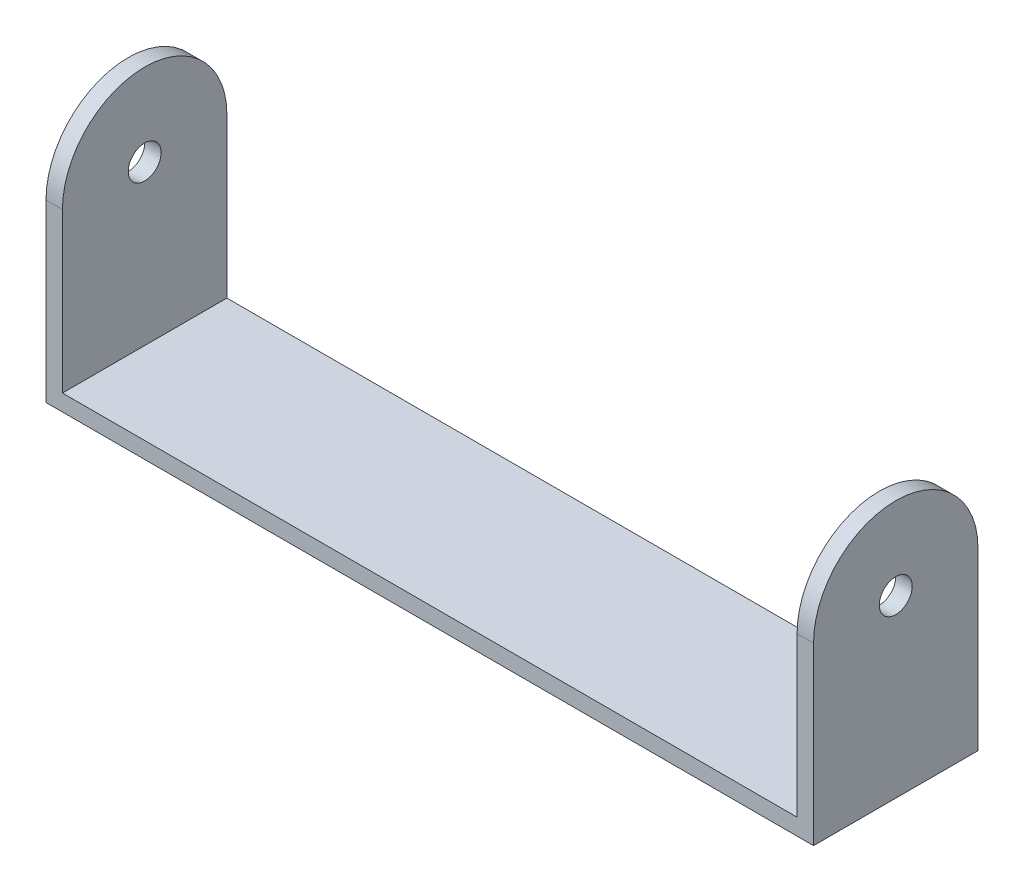
ISO-10303-21;
HEADER;
FILE_DESCRIPTION(('STEP AP214'),'2;1');
FILE_NAME('part.step','',(''),(''),'','','');
FILE_SCHEMA(('AUTOMOTIVE_DESIGN { 1 0 10303 214 1 1 1 1 }'));
ENDSEC;
DATA;
#1=APPLICATION_CONTEXT('core data for automotive mechanical design processes');
#2=APPLICATION_PROTOCOL_DEFINITION('international standard','automotive_design',2000,#1);
#3=PRODUCT_CONTEXT('',#1,'mechanical');
#4=PRODUCT('Part','Part','',(#3));
#5=PRODUCT_RELATED_PRODUCT_CATEGORY('part','',(#4));
#6=PRODUCT_DEFINITION_FORMATION('','',#4);
#7=PRODUCT_DEFINITION_CONTEXT('part definition',#1,'design');
#8=PRODUCT_DEFINITION('design','',#6,#7);
#9=PRODUCT_DEFINITION_SHAPE('','',#8);
#10=(LENGTH_UNIT() NAMED_UNIT(*) SI_UNIT(.MILLI.,.METRE.));
#11=(NAMED_UNIT(*) PLANE_ANGLE_UNIT() SI_UNIT($,.RADIAN.));
#12=(NAMED_UNIT(*) SI_UNIT($,.STERADIAN.) SOLID_ANGLE_UNIT());
#13=UNCERTAINTY_MEASURE_WITH_UNIT(LENGTH_MEASURE(1.E-05),#10,'distance_accuracy_value','');
#14=(GEOMETRIC_REPRESENTATION_CONTEXT(3) GLOBAL_UNCERTAINTY_ASSIGNED_CONTEXT((#13)) GLOBAL_UNIT_ASSIGNED_CONTEXT((#10,
#11,#12)) REPRESENTATION_CONTEXT('',''));
#15=CARTESIAN_POINT('',(0.,0.,0.));
#16=DIRECTION('',(0.,0.,1.));
#17=DIRECTION('',(1.,0.,0.));
#18=AXIS2_PLACEMENT_3D('',#15,#16,#17);
#19=CARTESIAN_POINT('',(35.,1.5,-7.5));
#20=DIRECTION('',(-1.,0.,0.));
#21=DIRECTION('',(0.,0.,1.));
#22=AXIS2_PLACEMENT_3D('',#19,#20,#21);
#23=PLANE('',#22);
#24=CARTESIAN_POINT('',(35.,16.,0.));
#25=DIRECTION('',(-1.,0.,0.));
#26=DIRECTION('',(0.,0.,1.));
#27=AXIS2_PLACEMENT_3D('',#24,#25,#26);
#28=CIRCLE('',#27,1.5);
#29=CARTESIAN_POINT('',(35.,16.,1.5));
#30=VERTEX_POINT('',#29);
#31=EDGE_CURVE('E162',#30,#30,#28,.T.);
#32=ORIENTED_EDGE('',*,*,#31,.T.);
#33=EDGE_LOOP('',(#32));
#34=FACE_BOUND('',#33,.T.);
#35=CARTESIAN_POINT('',(35.,16.,0.));
#36=DIRECTION('',(-1.,0.,0.));
#37=DIRECTION('',(0.,0.,1.));
#38=AXIS2_PLACEMENT_3D('',#35,#36,#37);
#39=CIRCLE('',#38,7.5);
#40=CARTESIAN_POINT('',(35.,16.,7.5));
#41=VERTEX_POINT('',#40);
#42=CARTESIAN_POINT('',(35.,16.,-7.5));
#43=VERTEX_POINT('',#42);
#44=EDGE_CURVE('E133',#41,#43,#39,.T.);
#45=ORIENTED_EDGE('',*,*,#44,.F.);
#46=DIRECTION('',(0.,-1.,0.));
#47=VECTOR('',#46,1.);
#48=CARTESIAN_POINT('',(35.,1.5,7.5));
#49=LINE('',#48,#47);
#50=CARTESIAN_POINT('',(35.,0.,7.5));
#51=VERTEX_POINT('',#50);
#52=EDGE_CURVE('E147',#41,#51,#49,.T.);
#53=ORIENTED_EDGE('',*,*,#52,.T.);
#54=DIRECTION('',(0.,0.,-1.));
#55=VECTOR('',#54,1.);
#56=CARTESIAN_POINT('',(35.,0.,-7.5));
#57=LINE('',#56,#55);
#58=CARTESIAN_POINT('',(35.,0.,-7.5));
#59=VERTEX_POINT('',#58);
#60=EDGE_CURVE('E188',#51,#59,#57,.T.);
#61=ORIENTED_EDGE('',*,*,#60,.T.);
#62=DIRECTION('',(0.,-1.,0.));
#63=VECTOR('',#62,1.);
#64=CARTESIAN_POINT('',(35.,1.5,-7.5));
#65=LINE('',#64,#63);
#66=EDGE_CURVE('E64',#43,#59,#65,.T.);
#67=ORIENTED_EDGE('',*,*,#66,.F.);
#68=EDGE_LOOP('',(#45,#53,#61,#67));
#69=FACE_BOUND('',#68,.T.);
#70=ADVANCED_FACE('F57',(#34,#69),#23,.F.);
#71=CARTESIAN_POINT('',(-35.,1.5,-7.5));
#72=DIRECTION('',(1.,0.,0.));
#73=DIRECTION('',(0.,0.,-1.));
#74=AXIS2_PLACEMENT_3D('',#71,#72,#73);
#75=PLANE('',#74);
#76=CARTESIAN_POINT('',(-35.,16.,0.));
#77=DIRECTION('',(-1.,0.,0.));
#78=DIRECTION('',(0.,0.,1.));
#79=AXIS2_PLACEMENT_3D('',#76,#77,#78);
#80=CIRCLE('',#79,1.5);
#81=CARTESIAN_POINT('',(-35.,16.,1.5));
#82=VERTEX_POINT('',#81);
#83=EDGE_CURVE('E156',#82,#82,#80,.T.);
#84=ORIENTED_EDGE('',*,*,#83,.F.);
#85=EDGE_LOOP('',(#84));
#86=FACE_BOUND('',#85,.T.);
#87=DIRECTION('',(0.,-1.,0.));
#88=VECTOR('',#87,1.);
#89=CARTESIAN_POINT('',(-35.,1.5,7.5));
#90=LINE('',#89,#88);
#91=CARTESIAN_POINT('',(-35.,16.,7.5));
#92=VERTEX_POINT('',#91);
#93=CARTESIAN_POINT('',(-35.,0.,7.5));
#94=VERTEX_POINT('',#93);
#95=EDGE_CURVE('E139',#92,#94,#90,.T.);
#96=ORIENTED_EDGE('',*,*,#95,.F.);
#97=CARTESIAN_POINT('',(-35.,16.,0.));
#98=DIRECTION('',(-1.,0.,0.));
#99=DIRECTION('',(0.,0.,1.));
#100=AXIS2_PLACEMENT_3D('',#97,#98,#99);
#101=CIRCLE('',#100,7.5);
#102=CARTESIAN_POINT('',(-35.,16.,-7.5));
#103=VERTEX_POINT('',#102);
#104=EDGE_CURVE('E125',#92,#103,#101,.T.);
#105=ORIENTED_EDGE('',*,*,#104,.T.);
#106=DIRECTION('',(0.,-1.,0.));
#107=VECTOR('',#106,1.);
#108=CARTESIAN_POINT('',(-35.,1.5,-7.5));
#109=LINE('',#108,#107);
#110=CARTESIAN_POINT('',(-35.,0.,-7.5));
#111=VERTEX_POINT('',#110);
#112=EDGE_CURVE('E146',#103,#111,#109,.T.);
#113=ORIENTED_EDGE('',*,*,#112,.T.);
#114=DIRECTION('',(0.,0.,1.));
#115=VECTOR('',#114,1.);
#116=CARTESIAN_POINT('',(-35.,0.,-7.5));
#117=LINE('',#116,#115);
#118=EDGE_CURVE('E144',#111,#94,#117,.T.);
#119=ORIENTED_EDGE('',*,*,#118,.T.);
#120=EDGE_LOOP('',(#96,#105,#113,#119));
#121=FACE_BOUND('',#120,.T.);
#122=ADVANCED_FACE('F142',(#86,#121),#75,.F.);
#123=CARTESIAN_POINT('',(-33.5,23.5,7.5));
#124=DIRECTION('',(-1.,0.,0.));
#125=DIRECTION('',(0.,0.,1.));
#126=AXIS2_PLACEMENT_3D('',#123,#124,#125);
#127=PLANE('',#126);
#128=CARTESIAN_POINT('',(-33.5,16.,0.));
#129=DIRECTION('',(-1.,0.,0.));
#130=DIRECTION('',(0.,0.,1.));
#131=AXIS2_PLACEMENT_3D('',#128,#129,#130);
#132=CIRCLE('',#131,1.5);
#133=CARTESIAN_POINT('',(-33.5,16.,1.5));
#134=VERTEX_POINT('',#133);
#135=EDGE_CURVE('E134',#134,#134,#132,.T.);
#136=ORIENTED_EDGE('',*,*,#135,.T.);
#137=EDGE_LOOP('',(#136));
#138=FACE_BOUND('',#137,.T.);
#139=CARTESIAN_POINT('',(-33.5,16.,0.));
#140=DIRECTION('',(-1.,0.,0.));
#141=DIRECTION('',(0.,0.,1.));
#142=AXIS2_PLACEMENT_3D('',#139,#140,#141);
#143=CIRCLE('',#142,7.5);
#144=CARTESIAN_POINT('',(-33.5,16.,7.5));
#145=VERTEX_POINT('',#144);
#146=CARTESIAN_POINT('',(-33.5,16.,-7.5));
#147=VERTEX_POINT('',#146);
#148=EDGE_CURVE('E176',#145,#147,#143,.T.);
#149=ORIENTED_EDGE('',*,*,#148,.F.);
#150=DIRECTION('',(0.,-1.,0.));
#151=VECTOR('',#150,1.);
#152=CARTESIAN_POINT('',(-33.5,23.5,7.5));
#153=LINE('',#152,#151);
#154=CARTESIAN_POINT('',(-33.5,1.5,7.5));
#155=VERTEX_POINT('',#154);
#156=EDGE_CURVE('E141',#145,#155,#153,.T.);
#157=ORIENTED_EDGE('',*,*,#156,.T.);
#158=DIRECTION('',(0.,0.,-1.));
#159=VECTOR('',#158,1.);
#160=CARTESIAN_POINT('',(-33.5,1.5,7.5));
#161=LINE('',#160,#159);
#162=CARTESIAN_POINT('',(-33.5,1.5,-7.5));
#163=VERTEX_POINT('',#162);
#164=EDGE_CURVE('E182',#155,#163,#161,.T.);
#165=ORIENTED_EDGE('',*,*,#164,.T.);
#166=DIRECTION('',(0.,-1.,0.));
#167=VECTOR('',#166,1.);
#168=CARTESIAN_POINT('',(-33.5,23.5,-7.5));
#169=LINE('',#168,#167);
#170=EDGE_CURVE('E185',#147,#163,#169,.T.);
#171=ORIENTED_EDGE('',*,*,#170,.F.);
#172=EDGE_LOOP('',(#149,#157,#165,#171));
#173=FACE_BOUND('',#172,.T.);
#174=ADVANCED_FACE('F218',(#138,#173),#127,.F.);
#175=CARTESIAN_POINT('',(33.5,23.5,-7.5));
#176=DIRECTION('',(1.,0.,0.));
#177=DIRECTION('',(0.,0.,-1.));
#178=AXIS2_PLACEMENT_3D('',#175,#176,#177);
#179=PLANE('',#178);
#180=CARTESIAN_POINT('',(33.5,16.,0.));
#181=DIRECTION('',(1.,0.,0.));
#182=DIRECTION('',(0.,0.,-1.));
#183=AXIS2_PLACEMENT_3D('',#180,#181,#182);
#184=CIRCLE('',#183,1.5);
#185=CARTESIAN_POINT('',(33.5,16.,-1.5));
#186=VERTEX_POINT('',#185);
#187=EDGE_CURVE('E154',#186,#186,#184,.T.);
#188=ORIENTED_EDGE('',*,*,#187,.T.);
#189=EDGE_LOOP('',(#188));
#190=FACE_BOUND('',#189,.T.);
#191=DIRECTION('',(0.,-1.,0.));
#192=VECTOR('',#191,1.);
#193=CARTESIAN_POINT('',(33.5,23.5,7.5));
#194=LINE('',#193,#192);
#195=CARTESIAN_POINT('',(33.5,16.,7.5));
#196=VERTEX_POINT('',#195);
#197=CARTESIAN_POINT('',(33.5,1.5,7.5));
#198=VERTEX_POINT('',#197);
#199=EDGE_CURVE('E79',#196,#198,#194,.T.);
#200=ORIENTED_EDGE('',*,*,#199,.F.);
#201=CARTESIAN_POINT('',(33.5,16.,0.));
#202=DIRECTION('',(1.,0.,0.));
#203=DIRECTION('',(0.,0.,-1.));
#204=AXIS2_PLACEMENT_3D('',#201,#202,#203);
#205=CIRCLE('',#204,7.5);
#206=CARTESIAN_POINT('',(33.5,16.,-7.5));
#207=VERTEX_POINT('',#206);
#208=EDGE_CURVE('E174',#207,#196,#205,.T.);
#209=ORIENTED_EDGE('',*,*,#208,.F.);
#210=DIRECTION('',(0.,-1.,0.));
#211=VECTOR('',#210,1.);
#212=CARTESIAN_POINT('',(33.5,23.5,-7.5));
#213=LINE('',#212,#211);
#214=CARTESIAN_POINT('',(33.5,1.5,-7.5));
#215=VERTEX_POINT('',#214);
#216=EDGE_CURVE('E71',#207,#215,#213,.T.);
#217=ORIENTED_EDGE('',*,*,#216,.T.);
#218=DIRECTION('',(0.,0.,1.));
#219=VECTOR('',#218,1.);
#220=CARTESIAN_POINT('',(33.5,1.5,-7.5));
#221=LINE('',#220,#219);
#222=EDGE_CURVE('E178',#215,#198,#221,.T.);
#223=ORIENTED_EDGE('',*,*,#222,.T.);
#224=EDGE_LOOP('',(#200,#209,#217,#223));
#225=FACE_BOUND('',#224,.T.);
#226=ADVANCED_FACE('F209',(#190,#225),#179,.F.);
#227=CARTESIAN_POINT('',(-35.,1.5,-7.5));
#228=DIRECTION('',(0.,0.,1.));
#229=DIRECTION('',(1.,0.,0.));
#230=AXIS2_PLACEMENT_3D('',#227,#228,#229);
#231=PLANE('',#230);
#232=DIRECTION('',(-1.,0.,0.));
#233=VECTOR('',#232,1.);
#234=CARTESIAN_POINT('',(35.,16.,-7.5));
#235=LINE('',#234,#233);
#236=EDGE_CURVE('E172',#43,#207,#235,.T.);
#237=ORIENTED_EDGE('',*,*,#236,.F.);
#238=ORIENTED_EDGE('',*,*,#66,.T.);
#239=DIRECTION('',(-1.,0.,0.));
#240=VECTOR('',#239,1.);
#241=CARTESIAN_POINT('',(-35.,0.,-7.5));
#242=LINE('',#241,#240);
#243=EDGE_CURVE('E196',#59,#111,#242,.T.);
#244=ORIENTED_EDGE('',*,*,#243,.T.);
#245=ORIENTED_EDGE('',*,*,#112,.F.);
#246=EDGE_CURVE('E129',#147,#103,#235,.T.);
#247=ORIENTED_EDGE('',*,*,#246,.F.);
#248=ORIENTED_EDGE('',*,*,#170,.T.);
#249=DIRECTION('',(-1.,0.,0.));
#250=VECTOR('',#249,1.);
#251=CARTESIAN_POINT('',(-35.,1.5,-7.5));
#252=LINE('',#251,#250);
#253=EDGE_CURVE('E189',#215,#163,#252,.T.);
#254=ORIENTED_EDGE('',*,*,#253,.F.);
#255=ORIENTED_EDGE('',*,*,#216,.F.);
#256=EDGE_LOOP('',(#237,#238,#244,#245,#247,#248,#254,#255));
#257=FACE_BOUND('',#256,.T.);
#258=ADVANCED_FACE('F215',(#257),#231,.F.);
#259=CARTESIAN_POINT('',(0.,1.5,0.));
#260=DIRECTION('',(0.,1.,0.));
#261=DIRECTION('',(0.,0.,1.));
#262=AXIS2_PLACEMENT_3D('',#259,#260,#261);
#263=PLANE('',#262);
#264=DIRECTION('',(1.,0.,0.));
#265=VECTOR('',#264,1.);
#266=CARTESIAN_POINT('',(-35.,1.5,7.5));
#267=LINE('',#266,#265);
#268=EDGE_CURVE('E150',#155,#198,#267,.T.);
#269=ORIENTED_EDGE('',*,*,#268,.T.);
#270=ORIENTED_EDGE('',*,*,#222,.F.);
#271=ORIENTED_EDGE('',*,*,#253,.T.);
#272=ORIENTED_EDGE('',*,*,#164,.F.);
#273=EDGE_LOOP('',(#269,#270,#271,#272));
#274=FACE_BOUND('',#273,.T.);
#275=ADVANCED_FACE('F212',(#274),#263,.T.);
#276=CARTESIAN_POINT('',(-35.,1.5,7.5));
#277=DIRECTION('',(0.,0.,-1.));
#278=DIRECTION('',(-1.,0.,0.));
#279=AXIS2_PLACEMENT_3D('',#276,#277,#278);
#280=PLANE('',#279);
#281=ORIENTED_EDGE('',*,*,#52,.F.);
#282=DIRECTION('',(-1.,0.,0.));
#283=VECTOR('',#282,1.);
#284=CARTESIAN_POINT('',(35.,16.,7.5));
#285=LINE('',#284,#283);
#286=EDGE_CURVE('E167',#41,#196,#285,.T.);
#287=ORIENTED_EDGE('',*,*,#286,.T.);
#288=ORIENTED_EDGE('',*,*,#199,.T.);
#289=ORIENTED_EDGE('',*,*,#268,.F.);
#290=ORIENTED_EDGE('',*,*,#156,.F.);
#291=DIRECTION('',(-1.,0.,0.));
#292=VECTOR('',#291,1.);
#293=CARTESIAN_POINT('',(35.,16.,7.5));
#294=LINE('',#293,#292);
#295=EDGE_CURVE('E12',#145,#92,#294,.T.);
#296=ORIENTED_EDGE('',*,*,#295,.T.);
#297=ORIENTED_EDGE('',*,*,#95,.T.);
#298=DIRECTION('',(1.,0.,0.));
#299=VECTOR('',#298,1.);
#300=CARTESIAN_POINT('',(-35.,0.,7.5));
#301=LINE('',#300,#299);
#302=EDGE_CURVE('E192',#94,#51,#301,.T.);
#303=ORIENTED_EDGE('',*,*,#302,.T.);
#304=EDGE_LOOP('',(#281,#287,#288,#289,#290,#296,#297,#303));
#305=FACE_BOUND('',#304,.T.);
#306=ADVANCED_FACE('F137',(#305),#280,.F.);
#307=CARTESIAN_POINT('',(0.,0.,0.));
#308=DIRECTION('',(0.,1.,0.));
#309=DIRECTION('',(0.,0.,1.));
#310=AXIS2_PLACEMENT_3D('',#307,#308,#309);
#311=PLANE('',#310);
#312=ORIENTED_EDGE('',*,*,#60,.F.);
#313=ORIENTED_EDGE('',*,*,#302,.F.);
#314=ORIENTED_EDGE('',*,*,#118,.F.);
#315=ORIENTED_EDGE('',*,*,#243,.F.);
#316=EDGE_LOOP('',(#312,#313,#314,#315));
#317=FACE_BOUND('',#316,.T.);
#318=ADVANCED_FACE('F202',(#317),#311,.F.);
#319=CARTESIAN_POINT('',(35.,16.,0.));
#320=DIRECTION('',(-1.,0.,0.));
#321=DIRECTION('',(0.,0.,1.));
#322=AXIS2_PLACEMENT_3D('',#319,#320,#321);
#323=CYLINDRICAL_SURFACE('',#322,7.5);
#324=ORIENTED_EDGE('',*,*,#208,.T.);
#325=ORIENTED_EDGE('',*,*,#286,.F.);
#326=ORIENTED_EDGE('',*,*,#44,.T.);
#327=ORIENTED_EDGE('',*,*,#236,.T.);
#328=EDGE_LOOP('',(#324,#325,#326,#327));
#329=FACE_BOUND('',#328,.T.);
#330=ADVANCED_FACE('F208',(#329),#323,.T.);
#331=ORIENTED_EDGE('',*,*,#148,.T.);
#332=ORIENTED_EDGE('',*,*,#246,.T.);
#333=ORIENTED_EDGE('',*,*,#104,.F.);
#334=ORIENTED_EDGE('',*,*,#295,.F.);
#335=EDGE_LOOP('',(#331,#332,#333,#334));
#336=FACE_BOUND('',#335,.T.);
#337=ADVANCED_FACE('F126',(#336),#323,.T.);
#338=CARTESIAN_POINT('',(35.,16.,0.));
#339=DIRECTION('',(-1.,0.,0.));
#340=DIRECTION('',(0.,0.,1.));
#341=AXIS2_PLACEMENT_3D('',#338,#339,#340);
#342=CYLINDRICAL_SURFACE('',#341,1.5);
#343=ORIENTED_EDGE('',*,*,#31,.F.);
#344=EDGE_LOOP('',(#343));
#345=FACE_BOUND('',#344,.T.);
#346=ORIENTED_EDGE('',*,*,#187,.F.);
#347=EDGE_LOOP('',(#346));
#348=FACE_BOUND('',#347,.T.);
#349=ADVANCED_FACE('F236',(#345,#348),#342,.F.);
#350=ORIENTED_EDGE('',*,*,#83,.T.);
#351=EDGE_LOOP('',(#350));
#352=FACE_BOUND('',#351,.T.);
#353=ORIENTED_EDGE('',*,*,#135,.F.);
#354=EDGE_LOOP('',(#353));
#355=FACE_BOUND('',#354,.T.);
#356=ADVANCED_FACE('F239',(#352,#355),#342,.F.);
#357=CLOSED_SHELL('',(#70,#122,#174,#226,#258,#275,#306,#318,#330,#337,#349,#356));
#358=MANIFOLD_SOLID_BREP('B2',#357);
#359=ADVANCED_BREP_SHAPE_REPRESENTATION('',(#18,#358),#14);
#360=SHAPE_DEFINITION_REPRESENTATION(#9,#359);
ENDSEC;
END-ISO-10303-21;
